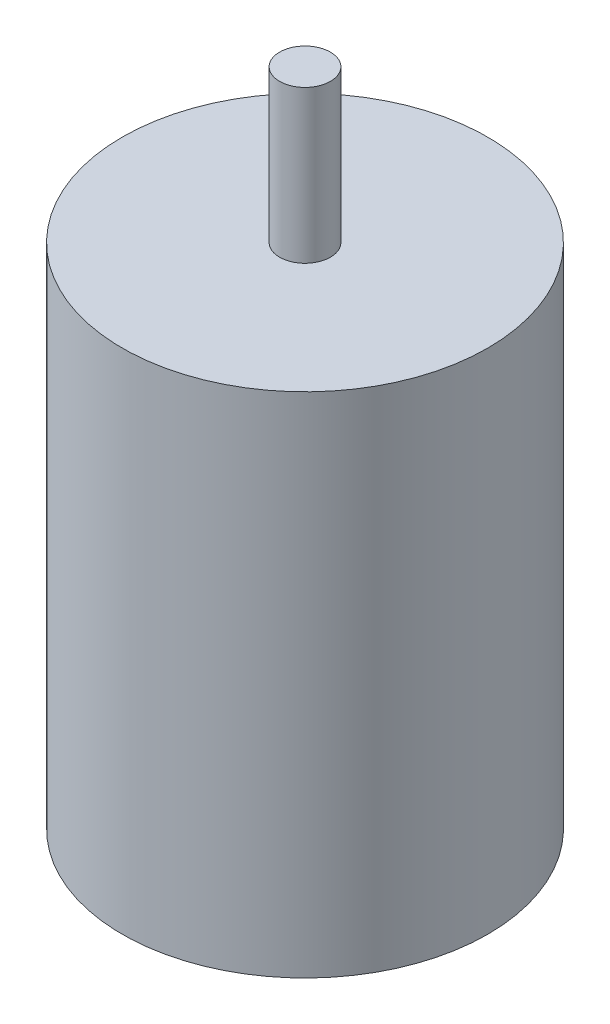
ISO-10303-21;
HEADER;
FILE_DESCRIPTION(('STEP AP214'),'2;1');
FILE_NAME('part.step','',(''),(''),'','','');
FILE_SCHEMA(('AUTOMOTIVE_DESIGN { 1 0 10303 214 1 1 1 1 }'));
ENDSEC;
DATA;
#1=APPLICATION_CONTEXT('core data for automotive mechanical design processes');
#2=APPLICATION_PROTOCOL_DEFINITION('international standard','automotive_design',2000,#1);
#3=PRODUCT_CONTEXT('',#1,'mechanical');
#4=PRODUCT('Part','Part','',(#3));
#5=PRODUCT_RELATED_PRODUCT_CATEGORY('part','',(#4));
#6=PRODUCT_DEFINITION_FORMATION('','',#4);
#7=PRODUCT_DEFINITION_CONTEXT('part definition',#1,'design');
#8=PRODUCT_DEFINITION('design','',#6,#7);
#9=PRODUCT_DEFINITION_SHAPE('','',#8);
#10=(LENGTH_UNIT() NAMED_UNIT(*) SI_UNIT(.MILLI.,.METRE.));
#11=(NAMED_UNIT(*) PLANE_ANGLE_UNIT() SI_UNIT($,.RADIAN.));
#12=(NAMED_UNIT(*) SI_UNIT($,.STERADIAN.) SOLID_ANGLE_UNIT());
#13=UNCERTAINTY_MEASURE_WITH_UNIT(LENGTH_MEASURE(1.E-05),#10,'distance_accuracy_value','');
#14=(GEOMETRIC_REPRESENTATION_CONTEXT(3) GLOBAL_UNCERTAINTY_ASSIGNED_CONTEXT((#13)) GLOBAL_UNIT_ASSIGNED_CONTEXT((#10,
#11,#12)) REPRESENTATION_CONTEXT('',''));
#15=CARTESIAN_POINT('',(0.,0.,0.));
#16=DIRECTION('',(0.,0.,1.));
#17=DIRECTION('',(1.,0.,0.));
#18=AXIS2_PLACEMENT_3D('',#15,#16,#17);
#19=CARTESIAN_POINT('',(0.,25.,0.));
#20=DIRECTION('',(0.,1.,0.));
#21=DIRECTION('',(1.,0.,0.));
#22=AXIS2_PLACEMENT_3D('',#19,#20,#21);
#23=PLANE('',#22);
#24=CARTESIAN_POINT('',(0.,25.,0.));
#25=DIRECTION('',(0.,-1.,0.));
#26=DIRECTION('',(-1.,0.,0.));
#27=AXIS2_PLACEMENT_3D('',#24,#25,#26);
#28=CIRCLE('',#27,2.5);
#29=CARTESIAN_POINT('',(2.5,25.,0.));
#30=VERTEX_POINT('',#29);
#31=EDGE_CURVE('E47',#30,#30,#28,.T.);
#32=ORIENTED_EDGE('',*,*,#31,.T.);
#33=EDGE_LOOP('',(#32));
#34=FACE_BOUND('',#33,.T.);
#35=CARTESIAN_POINT('',(0.,25.,0.));
#36=DIRECTION('',(0.,1.,0.));
#37=DIRECTION('',(1.,0.,0.));
#38=AXIS2_PLACEMENT_3D('',#35,#36,#37);
#39=CIRCLE('',#38,18.);
#40=CARTESIAN_POINT('',(-18.,25.,0.));
#41=VERTEX_POINT('',#40);
#42=EDGE_CURVE('E26',#41,#41,#39,.T.);
#43=ORIENTED_EDGE('',*,*,#42,.T.);
#44=EDGE_LOOP('',(#43));
#45=FACE_BOUND('',#44,.T.);
#46=ADVANCED_FACE('F15',(#34,#45),#23,.T.);
#47=CARTESIAN_POINT('',(0.,0.,0.));
#48=DIRECTION('',(0.,1.,0.));
#49=DIRECTION('',(1.,0.,0.));
#50=AXIS2_PLACEMENT_3D('',#47,#48,#49);
#51=CYLINDRICAL_SURFACE('',#50,18.);
#52=ORIENTED_EDGE('',*,*,#42,.F.);
#53=DIRECTION('',(0.,-1.,0.));
#54=VECTOR('',#53,1.);
#55=CARTESIAN_POINT('',(-18.,0.,0.));
#56=LINE('',#55,#54);
#57=CARTESIAN_POINT('',(-18.,-25.,0.));
#58=VERTEX_POINT('',#57);
#59=EDGE_CURVE('E10',#41,#58,#56,.T.);
#60=ORIENTED_EDGE('',*,*,#59,.T.);
#61=CARTESIAN_POINT('',(0.,-25.,0.));
#62=DIRECTION('',(0.,-1.,0.));
#63=DIRECTION('',(1.,0.,0.));
#64=AXIS2_PLACEMENT_3D('',#61,#62,#63);
#65=CIRCLE('',#64,18.);
#66=EDGE_CURVE('E65',#58,#58,#65,.T.);
#67=ORIENTED_EDGE('',*,*,#66,.F.);
#68=ORIENTED_EDGE('',*,*,#59,.F.);
#69=EDGE_LOOP('',(#52,#60,#67,#68));
#70=FACE_BOUND('',#69,.T.);
#71=ADVANCED_FACE('F17',(#70),#51,.T.);
#72=CARTESIAN_POINT('',(0.,-25.,0.));
#73=DIRECTION('',(0.,1.,0.));
#74=DIRECTION('',(1.,0.,0.));
#75=AXIS2_PLACEMENT_3D('',#72,#73,#74);
#76=PLANE('',#75);
#77=ORIENTED_EDGE('',*,*,#66,.T.);
#78=EDGE_LOOP('',(#77));
#79=FACE_BOUND('',#78,.T.);
#80=ADVANCED_FACE('F87',(#79),#76,.F.);
#81=CARTESIAN_POINT('',(0.,40.,0.));
#82=DIRECTION('',(0.,1.,0.));
#83=DIRECTION('',(1.,0.,0.));
#84=AXIS2_PLACEMENT_3D('',#81,#82,#83);
#85=PLANE('',#84);
#86=CARTESIAN_POINT('',(0.,40.,0.));
#87=DIRECTION('',(0.,1.,0.));
#88=DIRECTION('',(-1.,0.,0.));
#89=AXIS2_PLACEMENT_3D('',#86,#87,#88);
#90=CIRCLE('',#89,2.5);
#91=CARTESIAN_POINT('',(2.5,40.,0.));
#92=VERTEX_POINT('',#91);
#93=EDGE_CURVE('E57',#92,#92,#90,.T.);
#94=ORIENTED_EDGE('',*,*,#93,.T.);
#95=EDGE_LOOP('',(#94));
#96=FACE_BOUND('',#95,.T.);
#97=ADVANCED_FACE('F60',(#96),#85,.T.);
#98=CARTESIAN_POINT('',(0.,25.,0.));
#99=DIRECTION('',(0.,1.,0.));
#100=DIRECTION('',(-1.,0.,0.));
#101=AXIS2_PLACEMENT_3D('',#98,#99,#100);
#102=CYLINDRICAL_SURFACE('',#101,2.5);
#103=ORIENTED_EDGE('',*,*,#93,.F.);
#104=DIRECTION('',(0.,-1.,0.));
#105=VECTOR('',#104,1.);
#106=CARTESIAN_POINT('',(2.5,25.,0.));
#107=LINE('',#106,#105);
#108=EDGE_CURVE('E19',#92,#30,#107,.T.);
#109=ORIENTED_EDGE('',*,*,#108,.T.);
#110=ORIENTED_EDGE('',*,*,#31,.F.);
#111=ORIENTED_EDGE('',*,*,#108,.F.);
#112=EDGE_LOOP('',(#103,#109,#110,#111));
#113=FACE_BOUND('',#112,.T.);
#114=ADVANCED_FACE('F56',(#113),#102,.T.);
#115=CLOSED_SHELL('',(#46,#71,#80,#97,#114));
#116=MANIFOLD_SOLID_BREP('B1',#115);
#117=ADVANCED_BREP_SHAPE_REPRESENTATION('',(#18,#116),#14);
#118=SHAPE_DEFINITION_REPRESENTATION(#9,#117);
ENDSEC;
END-ISO-10303-21;
